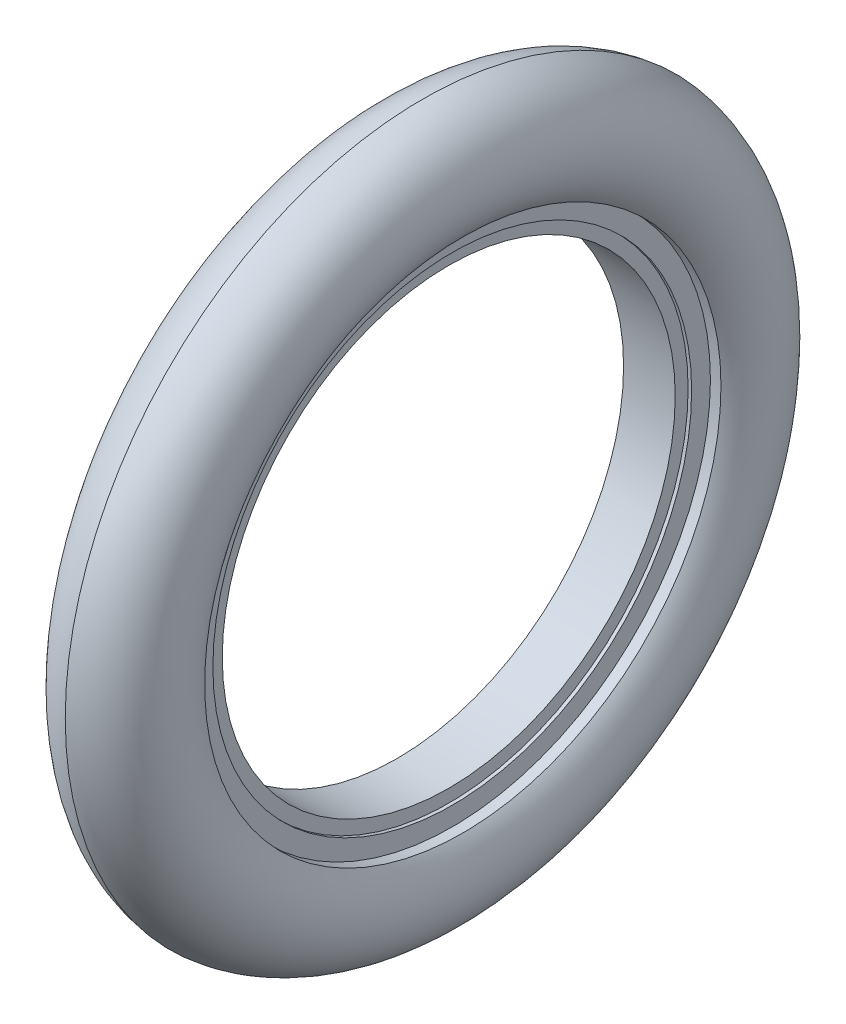
ISO-10303-21;
HEADER;
FILE_DESCRIPTION(('STEP AP214'),'2;1');
FILE_NAME('part.step','',(''),(''),'','','');
FILE_SCHEMA(('AUTOMOTIVE_DESIGN { 1 0 10303 214 1 1 1 1 }'));
ENDSEC;
DATA;
#1=APPLICATION_CONTEXT('core data for automotive mechanical design processes');
#2=APPLICATION_PROTOCOL_DEFINITION('international standard','automotive_design',2000,#1);
#3=PRODUCT_CONTEXT('',#1,'mechanical');
#4=PRODUCT('Part','Part','',(#3));
#5=PRODUCT_RELATED_PRODUCT_CATEGORY('part','',(#4));
#6=PRODUCT_DEFINITION_FORMATION('','',#4);
#7=PRODUCT_DEFINITION_CONTEXT('part definition',#1,'design');
#8=PRODUCT_DEFINITION('design','',#6,#7);
#9=PRODUCT_DEFINITION_SHAPE('','',#8);
#10=(LENGTH_UNIT() NAMED_UNIT(*) SI_UNIT(.MILLI.,.METRE.));
#11=(NAMED_UNIT(*) PLANE_ANGLE_UNIT() SI_UNIT($,.RADIAN.));
#12=(NAMED_UNIT(*) SI_UNIT($,.STERADIAN.) SOLID_ANGLE_UNIT());
#13=UNCERTAINTY_MEASURE_WITH_UNIT(LENGTH_MEASURE(1.E-05),#10,'distance_accuracy_value','');
#14=(GEOMETRIC_REPRESENTATION_CONTEXT(3) GLOBAL_UNCERTAINTY_ASSIGNED_CONTEXT((#13)) GLOBAL_UNIT_ASSIGNED_CONTEXT((#10,
#11,#12)) REPRESENTATION_CONTEXT('',''));
#15=CARTESIAN_POINT('',(0.,0.,0.));
#16=DIRECTION('',(0.,0.,1.));
#17=DIRECTION('',(1.,0.,0.));
#18=AXIS2_PLACEMENT_3D('',#15,#16,#17);
#19=CARTESIAN_POINT('',(-11.,0.,0.));
#20=DIRECTION('',(1.,0.,0.));
#21=DIRECTION('',(0.,0.,-1.));
#22=AXIS2_PLACEMENT_3D('',#19,#20,#21);
#23=CYLINDRICAL_SURFACE('',#22,96.5000000000001);
#24=CARTESIAN_POINT('',(-11.,0.,0.));
#25=DIRECTION('',(1.,0.,0.));
#26=DIRECTION('',(0.,0.,-1.));
#27=AXIS2_PLACEMENT_3D('',#24,#25,#26);
#28=CIRCLE('',#27,96.5000000000001);
#29=CARTESIAN_POINT('',(-11.,0.,-96.5000000000001));
#30=VERTEX_POINT('',#29);
#31=EDGE_CURVE('E19',#30,#30,#28,.T.);
#32=ORIENTED_EDGE('',*,*,#31,.F.);
#33=EDGE_LOOP('',(#32));
#34=FACE_BOUND('',#33,.T.);
#35=CARTESIAN_POINT('',(11.,0.,0.));
#36=DIRECTION('',(1.,0.,0.));
#37=DIRECTION('',(0.,0.,-1.));
#38=AXIS2_PLACEMENT_3D('',#35,#36,#37);
#39=CIRCLE('',#38,96.5000000000001);
#40=CARTESIAN_POINT('',(11.,0.,-96.5000000000001));
#41=VERTEX_POINT('',#40);
#42=EDGE_CURVE('E54',#41,#41,#39,.F.);
#43=ORIENTED_EDGE('',*,*,#42,.F.);
#44=EDGE_LOOP('',(#43));
#45=FACE_BOUND('',#44,.T.);
#46=ADVANCED_FACE('F14',(#34,#45),#23,.F.);
#47=CARTESIAN_POINT('',(-11.,-112.2,-112.2));
#48=DIRECTION('',(-1.,0.,0.));
#49=DIRECTION('',(0.,0.,1.));
#50=AXIS2_PLACEMENT_3D('',#47,#48,#49);
#51=PLANE('',#50);
#52=ORIENTED_EDGE('',*,*,#31,.T.);
#53=EDGE_LOOP('',(#52));
#54=FACE_BOUND('',#53,.T.);
#55=CARTESIAN_POINT('',(-11.,0.,0.));
#56=DIRECTION('',(1.,0.,0.));
#57=DIRECTION('',(0.,0.,-1.));
#58=AXIS2_PLACEMENT_3D('',#55,#56,#57);
#59=CIRCLE('',#58,102.);
#60=CARTESIAN_POINT('',(-11.,0.,-102.));
#61=VERTEX_POINT('',#60);
#62=EDGE_CURVE('E52',#61,#61,#59,.T.);
#63=ORIENTED_EDGE('',*,*,#62,.F.);
#64=EDGE_LOOP('',(#63));
#65=FACE_BOUND('',#64,.T.);
#66=ADVANCED_FACE('F61',(#54,#65),#51,.T.);
#67=CARTESIAN_POINT('',(11.,-112.2,112.2));
#68=DIRECTION('',(1.,0.,0.));
#69=DIRECTION('',(0.,0.,-1.));
#70=AXIS2_PLACEMENT_3D('',#67,#68,#69);
#71=PLANE('',#70);
#72=ORIENTED_EDGE('',*,*,#42,.T.);
#73=EDGE_LOOP('',(#72));
#74=FACE_BOUND('',#73,.T.);
#75=CARTESIAN_POINT('',(11.,0.,0.));
#76=DIRECTION('',(1.,0.,0.));
#77=DIRECTION('',(0.,0.,-1.));
#78=AXIS2_PLACEMENT_3D('',#75,#76,#77);
#79=CIRCLE('',#78,102.);
#80=CARTESIAN_POINT('',(11.,0.,-102.));
#81=VERTEX_POINT('',#80);
#82=EDGE_CURVE('E49',#81,#81,#79,.F.);
#83=ORIENTED_EDGE('',*,*,#82,.F.);
#84=EDGE_LOOP('',(#83));
#85=FACE_BOUND('',#84,.T.);
#86=ADVANCED_FACE('F71',(#74,#85),#71,.T.);
#87=CARTESIAN_POINT('',(-12.5,0.,0.));
#88=DIRECTION('',(1.,0.,0.));
#89=DIRECTION('',(0.,0.,-1.));
#90=AXIS2_PLACEMENT_3D('',#87,#88,#89);
#91=CYLINDRICAL_SURFACE('',#90,102.);
#92=ORIENTED_EDGE('',*,*,#62,.T.);
#93=EDGE_LOOP('',(#92));
#94=FACE_BOUND('',#93,.T.);
#95=CARTESIAN_POINT('',(-12.5,0.,0.));
#96=DIRECTION('',(1.,0.,0.));
#97=DIRECTION('',(0.,0.,-1.));
#98=AXIS2_PLACEMENT_3D('',#95,#96,#97);
#99=CIRCLE('',#98,102.);
#100=CARTESIAN_POINT('',(-12.5,0.,-102.));
#101=VERTEX_POINT('',#100);
#102=EDGE_CURVE('E46',#101,#101,#99,.T.);
#103=ORIENTED_EDGE('',*,*,#102,.F.);
#104=EDGE_LOOP('',(#103));
#105=FACE_BOUND('',#104,.T.);
#106=ADVANCED_FACE('F114',(#94,#105),#91,.F.);
#107=CARTESIAN_POINT('',(11.,0.,0.));
#108=DIRECTION('',(1.,0.,0.));
#109=DIRECTION('',(0.,0.,-1.));
#110=AXIS2_PLACEMENT_3D('',#107,#108,#109);
#111=CYLINDRICAL_SURFACE('',#110,102.);
#112=CARTESIAN_POINT('',(12.5,0.,0.));
#113=DIRECTION('',(1.,0.,0.));
#114=DIRECTION('',(0.,0.,-1.));
#115=AXIS2_PLACEMENT_3D('',#112,#113,#114);
#116=CIRCLE('',#115,102.);
#117=CARTESIAN_POINT('',(12.5,0.,-102.));
#118=VERTEX_POINT('',#117);
#119=EDGE_CURVE('E43',#118,#118,#116,.F.);
#120=ORIENTED_EDGE('',*,*,#119,.F.);
#121=EDGE_LOOP('',(#120));
#122=FACE_BOUND('',#121,.T.);
#123=ORIENTED_EDGE('',*,*,#82,.T.);
#124=EDGE_LOOP('',(#123));
#125=FACE_BOUND('',#124,.T.);
#126=ADVANCED_FACE('F100',(#122,#125),#111,.F.);
#127=CARTESIAN_POINT('',(-12.5,-121.,-121.));
#128=DIRECTION('',(-1.,0.,0.));
#129=DIRECTION('',(0.,0.,1.));
#130=AXIS2_PLACEMENT_3D('',#127,#128,#129);
#131=PLANE('',#130);
#132=ORIENTED_EDGE('',*,*,#102,.T.);
#133=EDGE_LOOP('',(#132));
#134=FACE_BOUND('',#133,.T.);
#135=CARTESIAN_POINT('',(-12.5,0.,0.));
#136=DIRECTION('',(1.,0.,0.));
#137=DIRECTION('',(0.,0.,-1.));
#138=AXIS2_PLACEMENT_3D('',#135,#136,#137);
#139=CIRCLE('',#138,110.);
#140=CARTESIAN_POINT('',(-12.5,0.,-110.));
#141=VERTEX_POINT('',#140);
#142=EDGE_CURVE('E40',#141,#141,#139,.T.);
#143=ORIENTED_EDGE('',*,*,#142,.F.);
#144=EDGE_LOOP('',(#143));
#145=FACE_BOUND('',#144,.T.);
#146=ADVANCED_FACE('F91',(#134,#145),#131,.T.);
#147=CARTESIAN_POINT('',(12.5,-121.,121.));
#148=DIRECTION('',(1.,0.,0.));
#149=DIRECTION('',(0.,0.,-1.));
#150=AXIS2_PLACEMENT_3D('',#147,#148,#149);
#151=PLANE('',#150);
#152=ORIENTED_EDGE('',*,*,#119,.T.);
#153=EDGE_LOOP('',(#152));
#154=FACE_BOUND('',#153,.T.);
#155=CARTESIAN_POINT('',(12.5,0.,0.));
#156=DIRECTION('',(1.,0.,0.));
#157=DIRECTION('',(0.,0.,-1.));
#158=AXIS2_PLACEMENT_3D('',#155,#156,#157);
#159=CIRCLE('',#158,110.);
#160=CARTESIAN_POINT('',(12.5,0.,-110.));
#161=VERTEX_POINT('',#160);
#162=EDGE_CURVE('E37',#161,#161,#159,.F.);
#163=ORIENTED_EDGE('',*,*,#162,.F.);
#164=EDGE_LOOP('',(#163));
#165=FACE_BOUND('',#164,.T.);
#166=ADVANCED_FACE('F89',(#154,#165),#151,.T.);
#167=CARTESIAN_POINT('',(-17.,0.,0.));
#168=DIRECTION('',(1.,0.,0.));
#169=DIRECTION('',(0.,0.,-1.));
#170=AXIS2_PLACEMENT_3D('',#167,#168,#169);
#171=CYLINDRICAL_SURFACE('',#170,110.);
#172=ORIENTED_EDGE('',*,*,#142,.T.);
#173=EDGE_LOOP('',(#172));
#174=FACE_BOUND('',#173,.T.);
#175=CARTESIAN_POINT('',(-17.0000000000001,0.,0.));
#176=DIRECTION('',(-1.,0.,0.));
#177=DIRECTION('',(0.,0.,-1.));
#178=AXIS2_PLACEMENT_3D('',#175,#176,#177);
#179=CIRCLE('',#178,110.);
#180=CARTESIAN_POINT('',(-17.0000000000001,0.,-110.));
#181=VERTEX_POINT('',#180);
#182=EDGE_CURVE('E28',#181,#181,#179,.F.);
#183=ORIENTED_EDGE('',*,*,#182,.F.);
#184=EDGE_LOOP('',(#183));
#185=FACE_BOUND('',#184,.T.);
#186=ADVANCED_FACE('F85',(#174,#185),#171,.F.);
#187=CARTESIAN_POINT('',(12.5,0.,0.));
#188=DIRECTION('',(1.,0.,0.));
#189=DIRECTION('',(0.,0.,-1.));
#190=AXIS2_PLACEMENT_3D('',#187,#188,#189);
#191=CYLINDRICAL_SURFACE('',#190,110.);
#192=CARTESIAN_POINT('',(17.0000000000001,0.,0.));
#193=DIRECTION('',(-1.,0.,0.));
#194=DIRECTION('',(0.,0.,-1.));
#195=AXIS2_PLACEMENT_3D('',#192,#193,#194);
#196=CIRCLE('',#195,110.);
#197=CARTESIAN_POINT('',(17.0000000000001,0.,-110.));
#198=VERTEX_POINT('',#197);
#199=EDGE_CURVE('E23',#198,#198,#196,.T.);
#200=ORIENTED_EDGE('',*,*,#199,.F.);
#201=EDGE_LOOP('',(#200));
#202=FACE_BOUND('',#201,.T.);
#203=ORIENTED_EDGE('',*,*,#162,.T.);
#204=EDGE_LOOP('',(#203));
#205=FACE_BOUND('',#204,.T.);
#206=ADVANCED_FACE('F78',(#202,#205),#191,.F.);
#207=CARTESIAN_POINT('',(2.60881108271449,0.,0.));
#208=DIRECTION('',(-1.,0.,0.));
#209=DIRECTION('',(0.,0.,-1.));
#210=AXIS2_PLACEMENT_3D('',#207,#208,#209);
#211=TOROIDAL_SURFACE('',#210,126.745995556459,25.7863110827146);
#212=ORIENTED_EDGE('',*,*,#182,.T.);
#213=EDGE_LOOP('',(#212));
#214=FACE_BOUND('',#213,.T.);
#215=CARTESIAN_POINT('',(0.,0.,0.));
#216=DIRECTION('',(-1.,0.,0.));
#217=DIRECTION('',(0.,0.,-1.));
#218=AXIS2_PLACEMENT_3D('',#215,#216,#217);
#219=CIRCLE('',#218,152.4);
#220=CARTESIAN_POINT('',(0.,0.,-152.4));
#221=VERTEX_POINT('',#220);
#222=EDGE_CURVE('E10',#221,#221,#219,.F.);
#223=ORIENTED_EDGE('',*,*,#222,.F.);
#224=EDGE_LOOP('',(#223));
#225=FACE_BOUND('',#224,.T.);
#226=ADVANCED_FACE('F74',(#214,#225),#211,.T.);
#227=CARTESIAN_POINT('',(-2.60881108271449,0.,0.));
#228=DIRECTION('',(-1.,0.,0.));
#229=DIRECTION('',(0.,0.,-1.));
#230=AXIS2_PLACEMENT_3D('',#227,#228,#229);
#231=TOROIDAL_SURFACE('',#230,126.745995556459,25.7863110827146);
#232=ORIENTED_EDGE('',*,*,#222,.T.);
#233=EDGE_LOOP('',(#232));
#234=FACE_BOUND('',#233,.T.);
#235=ORIENTED_EDGE('',*,*,#199,.T.);
#236=EDGE_LOOP('',(#235));
#237=FACE_BOUND('',#236,.T.);
#238=ADVANCED_FACE('F16',(#234,#237),#231,.T.);
#239=CLOSED_SHELL('',(#46,#66,#86,#106,#126,#146,#166,#186,#206,#226,#238));
#240=MANIFOLD_SOLID_BREP('B1',#239);
#241=ADVANCED_BREP_SHAPE_REPRESENTATION('',(#18,#240),#14);
#242=SHAPE_DEFINITION_REPRESENTATION(#9,#241);
ENDSEC;
END-ISO-10303-21;
